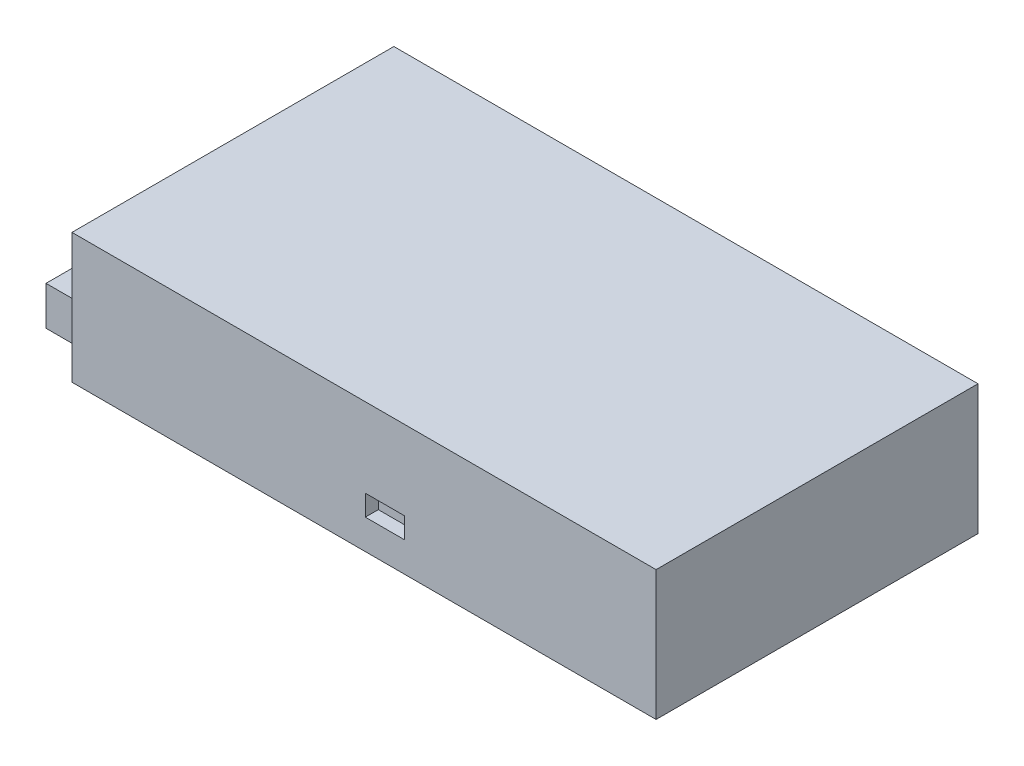
ISO-10303-21;
HEADER;
FILE_DESCRIPTION(('STEP AP214'),'2;1');
FILE_NAME('part.step','',(''),(''),'','','');
FILE_SCHEMA(('AUTOMOTIVE_DESIGN { 1 0 10303 214 1 1 1 1 }'));
ENDSEC;
DATA;
#1=APPLICATION_CONTEXT('core data for automotive mechanical design processes');
#2=APPLICATION_PROTOCOL_DEFINITION('international standard','automotive_design',2000,#1);
#3=PRODUCT_CONTEXT('',#1,'mechanical');
#4=PRODUCT('Part','Part','',(#3));
#5=PRODUCT_RELATED_PRODUCT_CATEGORY('part','',(#4));
#6=PRODUCT_DEFINITION_FORMATION('','',#4);
#7=PRODUCT_DEFINITION_CONTEXT('part definition',#1,'design');
#8=PRODUCT_DEFINITION('design','',#6,#7);
#9=PRODUCT_DEFINITION_SHAPE('','',#8);
#10=(LENGTH_UNIT() NAMED_UNIT(*) SI_UNIT(.MILLI.,.METRE.));
#11=(NAMED_UNIT(*) PLANE_ANGLE_UNIT() SI_UNIT($,.RADIAN.));
#12=(NAMED_UNIT(*) SI_UNIT($,.STERADIAN.) SOLID_ANGLE_UNIT());
#13=UNCERTAINTY_MEASURE_WITH_UNIT(LENGTH_MEASURE(1.E-05),#10,'distance_accuracy_value','');
#14=(GEOMETRIC_REPRESENTATION_CONTEXT(3) GLOBAL_UNCERTAINTY_ASSIGNED_CONTEXT((#13)) GLOBAL_UNIT_ASSIGNED_CONTEXT((#10,
#11,#12)) REPRESENTATION_CONTEXT('',''));
#15=CARTESIAN_POINT('',(0.,0.,0.));
#16=DIRECTION('',(0.,0.,1.));
#17=DIRECTION('',(1.,0.,0.));
#18=AXIS2_PLACEMENT_3D('',#15,#16,#17);
#19=CARTESIAN_POINT('',(-112.5,50.,-62.));
#20=DIRECTION('',(1.,0.,0.));
#21=DIRECTION('',(0.,0.,-1.));
#22=AXIS2_PLACEMENT_3D('',#19,#20,#21);
#23=PLANE('',#22);
#24=DIRECTION('',(0.,0.,1.));
#25=VECTOR('',#24,1.);
#26=CARTESIAN_POINT('',(-112.5,0.,-62.));
#27=LINE('',#26,#25);
#28=CARTESIAN_POINT('',(-112.5,0.,-62.));
#29=VERTEX_POINT('',#28);
#30=CARTESIAN_POINT('',(-112.5,0.,62.));
#31=VERTEX_POINT('',#30);
#32=EDGE_CURVE('E201',#29,#31,#27,.T.);
#33=ORIENTED_EDGE('',*,*,#32,.T.);
#34=DIRECTION('',(0.,-1.,0.));
#35=VECTOR('',#34,1.);
#36=CARTESIAN_POINT('',(-112.5,50.,62.));
#37=LINE('',#36,#35);
#38=CARTESIAN_POINT('',(-112.5,50.,62.));
#39=VERTEX_POINT('',#38);
#40=EDGE_CURVE('E11',#39,#31,#37,.T.);
#41=ORIENTED_EDGE('',*,*,#40,.F.);
#42=DIRECTION('',(0.,0.,1.));
#43=VECTOR('',#42,1.);
#44=CARTESIAN_POINT('',(-112.5,50.,-62.));
#45=LINE('',#44,#43);
#46=CARTESIAN_POINT('',(-112.5,50.,-62.));
#47=VERTEX_POINT('',#46);
#48=EDGE_CURVE('E204',#47,#39,#45,.T.);
#49=ORIENTED_EDGE('',*,*,#48,.F.);
#50=DIRECTION('',(0.,-1.,0.));
#51=VECTOR('',#50,1.);
#52=CARTESIAN_POINT('',(-112.5,50.,-62.));
#53=LINE('',#52,#51);
#54=EDGE_CURVE('E214',#47,#29,#53,.T.);
#55=ORIENTED_EDGE('',*,*,#54,.T.);
#56=EDGE_LOOP('',(#33,#41,#49,#55));
#57=FACE_BOUND('',#56,.T.);
#58=DIRECTION('',(0.,-1.,0.));
#59=VECTOR('',#58,1.);
#60=CARTESIAN_POINT('',(-112.5,25.,-47.));
#61=LINE('',#60,#59);
#62=CARTESIAN_POINT('',(-112.5,25.,-47.));
#63=VERTEX_POINT('',#62);
#64=CARTESIAN_POINT('',(-112.5,10.,-47.));
#65=VERTEX_POINT('',#64);
#66=EDGE_CURVE('E141',#63,#65,#61,.T.);
#67=ORIENTED_EDGE('',*,*,#66,.F.);
#68=DIRECTION('',(0.,0.,-1.));
#69=VECTOR('',#68,1.);
#70=CARTESIAN_POINT('',(-112.5,25.,-47.));
#71=LINE('',#70,#69);
#72=CARTESIAN_POINT('',(-112.5,25.,59.));
#73=VERTEX_POINT('',#72);
#74=EDGE_CURVE('E138',#73,#63,#71,.T.);
#75=ORIENTED_EDGE('',*,*,#74,.F.);
#76=DIRECTION('',(0.,1.,0.));
#77=VECTOR('',#76,1.);
#78=CARTESIAN_POINT('',(-112.5,25.,59.));
#79=LINE('',#78,#77);
#80=CARTESIAN_POINT('',(-112.5,10.,59.));
#81=VERTEX_POINT('',#80);
#82=EDGE_CURVE('E52',#81,#73,#79,.T.);
#83=ORIENTED_EDGE('',*,*,#82,.F.);
#84=DIRECTION('',(0.,0.,1.));
#85=VECTOR('',#84,1.);
#86=CARTESIAN_POINT('',(-112.5,10.,-47.));
#87=LINE('',#86,#85);
#88=EDGE_CURVE('E47',#65,#81,#87,.T.);
#89=ORIENTED_EDGE('',*,*,#88,.F.);
#90=EDGE_LOOP('',(#67,#75,#83,#89));
#91=FACE_BOUND('',#90,.T.);
#92=ADVANCED_FACE('F33',(#57,#91),#23,.F.);
#93=CARTESIAN_POINT('',(-112.5,50.,62.));
#94=DIRECTION('',(0.,0.,-1.));
#95=DIRECTION('',(-1.,0.,0.));
#96=AXIS2_PLACEMENT_3D('',#93,#94,#95);
#97=PLANE('',#96);
#98=DIRECTION('',(1.,0.,0.));
#99=VECTOR('',#98,1.);
#100=CARTESIAN_POINT('',(0.500000000000014,11.5,62.));
#101=LINE('',#100,#99);
#102=CARTESIAN_POINT('',(0.500000000000014,11.5,62.));
#103=VERTEX_POINT('',#102);
#104=CARTESIAN_POINT('',(15.5,11.5,62.));
#105=VERTEX_POINT('',#104);
#106=EDGE_CURVE('E144',#103,#105,#101,.T.);
#107=ORIENTED_EDGE('',*,*,#106,.F.);
#108=DIRECTION('',(0.,-1.,0.));
#109=VECTOR('',#108,1.);
#110=CARTESIAN_POINT('',(0.500000000000013,19.5,62.));
#111=LINE('',#110,#109);
#112=CARTESIAN_POINT('',(0.500000000000013,19.5,62.));
#113=VERTEX_POINT('',#112);
#114=EDGE_CURVE('E142',#113,#103,#111,.T.);
#115=ORIENTED_EDGE('',*,*,#114,.F.);
#116=DIRECTION('',(-1.,0.,0.));
#117=VECTOR('',#116,1.);
#118=CARTESIAN_POINT('',(0.500000000000013,19.5,62.));
#119=LINE('',#118,#117);
#120=CARTESIAN_POINT('',(15.5,19.5,62.));
#121=VERTEX_POINT('',#120);
#122=EDGE_CURVE('E154',#121,#113,#119,.T.);
#123=ORIENTED_EDGE('',*,*,#122,.F.);
#124=DIRECTION('',(0.,1.,0.));
#125=VECTOR('',#124,1.);
#126=CARTESIAN_POINT('',(15.5,19.5,62.));
#127=LINE('',#126,#125);
#128=EDGE_CURVE('E166',#105,#121,#127,.T.);
#129=ORIENTED_EDGE('',*,*,#128,.F.);
#130=EDGE_LOOP('',(#107,#115,#123,#129));
#131=FACE_BOUND('',#130,.T.);
#132=DIRECTION('',(1.,0.,0.));
#133=VECTOR('',#132,1.);
#134=CARTESIAN_POINT('',(-112.5,0.,62.));
#135=LINE('',#134,#133);
#136=CARTESIAN_POINT('',(112.5,0.,62.));
#137=VERTEX_POINT('',#136);
#138=EDGE_CURVE('E217',#31,#137,#135,.T.);
#139=ORIENTED_EDGE('',*,*,#138,.T.);
#140=DIRECTION('',(0.,-1.,0.));
#141=VECTOR('',#140,1.);
#142=CARTESIAN_POINT('',(112.5,50.,62.));
#143=LINE('',#142,#141);
#144=CARTESIAN_POINT('',(112.5,50.,62.));
#145=VERTEX_POINT('',#144);
#146=EDGE_CURVE('E40',#145,#137,#143,.T.);
#147=ORIENTED_EDGE('',*,*,#146,.F.);
#148=DIRECTION('',(1.,0.,0.));
#149=VECTOR('',#148,1.);
#150=CARTESIAN_POINT('',(-112.5,50.,62.));
#151=LINE('',#150,#149);
#152=EDGE_CURVE('E207',#39,#145,#151,.T.);
#153=ORIENTED_EDGE('',*,*,#152,.F.);
#154=ORIENTED_EDGE('',*,*,#40,.T.);
#155=EDGE_LOOP('',(#139,#147,#153,#154));
#156=FACE_BOUND('',#155,.T.);
#157=ADVANCED_FACE('F247',(#131,#156),#97,.F.);
#158=CARTESIAN_POINT('',(112.5,50.,-62.));
#159=DIRECTION('',(-1.,0.,0.));
#160=DIRECTION('',(0.,0.,1.));
#161=AXIS2_PLACEMENT_3D('',#158,#159,#160);
#162=PLANE('',#161);
#163=DIRECTION('',(0.,0.,-1.));
#164=VECTOR('',#163,1.);
#165=CARTESIAN_POINT('',(112.5,0.,-62.));
#166=LINE('',#165,#164);
#167=CARTESIAN_POINT('',(112.5,0.,-62.));
#168=VERTEX_POINT('',#167);
#169=EDGE_CURVE('E219',#137,#168,#166,.T.);
#170=ORIENTED_EDGE('',*,*,#169,.T.);
#171=DIRECTION('',(0.,-1.,0.));
#172=VECTOR('',#171,1.);
#173=CARTESIAN_POINT('',(112.5,50.,-62.));
#174=LINE('',#173,#172);
#175=CARTESIAN_POINT('',(112.5,50.,-62.));
#176=VERTEX_POINT('',#175);
#177=EDGE_CURVE('E224',#176,#168,#174,.T.);
#178=ORIENTED_EDGE('',*,*,#177,.F.);
#179=DIRECTION('',(0.,0.,-1.));
#180=VECTOR('',#179,1.);
#181=CARTESIAN_POINT('',(112.5,50.,-62.));
#182=LINE('',#181,#180);
#183=EDGE_CURVE('E210',#145,#176,#182,.T.);
#184=ORIENTED_EDGE('',*,*,#183,.F.);
#185=ORIENTED_EDGE('',*,*,#146,.T.);
#186=EDGE_LOOP('',(#170,#178,#184,#185));
#187=FACE_BOUND('',#186,.T.);
#188=ADVANCED_FACE('F231',(#187),#162,.F.);
#189=CARTESIAN_POINT('',(-112.5,50.,-62.));
#190=DIRECTION('',(0.,0.,1.));
#191=DIRECTION('',(1.,0.,0.));
#192=AXIS2_PLACEMENT_3D('',#189,#190,#191);
#193=PLANE('',#192);
#194=DIRECTION('',(-1.,0.,0.));
#195=VECTOR('',#194,1.);
#196=CARTESIAN_POINT('',(-112.5,0.,-62.));
#197=LINE('',#196,#195);
#198=EDGE_CURVE('E208',#168,#29,#197,.T.);
#199=ORIENTED_EDGE('',*,*,#198,.T.);
#200=ORIENTED_EDGE('',*,*,#54,.F.);
#201=DIRECTION('',(-1.,0.,0.));
#202=VECTOR('',#201,1.);
#203=CARTESIAN_POINT('',(-112.5,50.,-62.));
#204=LINE('',#203,#202);
#205=EDGE_CURVE('E212',#176,#47,#204,.T.);
#206=ORIENTED_EDGE('',*,*,#205,.F.);
#207=ORIENTED_EDGE('',*,*,#177,.T.);
#208=EDGE_LOOP('',(#199,#200,#206,#207));
#209=FACE_BOUND('',#208,.T.);
#210=ADVANCED_FACE('F240',(#209),#193,.F.);
#211=CARTESIAN_POINT('',(-112.5,50.,62.));
#212=DIRECTION('',(0.,1.,0.));
#213=DIRECTION('',(0.,0.,1.));
#214=AXIS2_PLACEMENT_3D('',#211,#212,#213);
#215=PLANE('',#214);
#216=ORIENTED_EDGE('',*,*,#48,.T.);
#217=ORIENTED_EDGE('',*,*,#152,.T.);
#218=ORIENTED_EDGE('',*,*,#183,.T.);
#219=ORIENTED_EDGE('',*,*,#205,.T.);
#220=EDGE_LOOP('',(#216,#217,#218,#219));
#221=FACE_BOUND('',#220,.T.);
#222=ADVANCED_FACE('F246',(#221),#215,.T.);
#223=CARTESIAN_POINT('',(-112.5,0.,62.));
#224=DIRECTION('',(0.,1.,0.));
#225=DIRECTION('',(0.,0.,1.));
#226=AXIS2_PLACEMENT_3D('',#223,#224,#225);
#227=PLANE('',#226);
#228=CARTESIAN_POINT('',(70.9999999999999,0.,24.5));
#229=DIRECTION('',(0.,-1.,0.));
#230=DIRECTION('',(0.,0.,-1.));
#231=AXIS2_PLACEMENT_3D('',#228,#229,#230);
#232=CIRCLE('',#231,2.);
#233=CARTESIAN_POINT('',(70.9999999999999,0.,22.5));
#234=VERTEX_POINT('',#233);
#235=EDGE_CURVE('E173',#234,#234,#232,.T.);
#236=ORIENTED_EDGE('',*,*,#235,.F.);
#237=EDGE_LOOP('',(#236));
#238=FACE_BOUND('',#237,.T.);
#239=CARTESIAN_POINT('',(70.9999999999999,0.,-25.5));
#240=DIRECTION('',(0.,-1.,0.));
#241=DIRECTION('',(0.,0.,-1.));
#242=AXIS2_PLACEMENT_3D('',#239,#240,#241);
#243=CIRCLE('',#242,2.);
#244=CARTESIAN_POINT('',(70.9999999999999,0.,-27.5));
#245=VERTEX_POINT('',#244);
#246=EDGE_CURVE('E183',#245,#245,#243,.T.);
#247=ORIENTED_EDGE('',*,*,#246,.F.);
#248=EDGE_LOOP('',(#247));
#249=FACE_BOUND('',#248,.T.);
#250=CARTESIAN_POINT('',(-79.0000000000001,0.,24.5));
#251=DIRECTION('',(0.,-1.,0.));
#252=DIRECTION('',(0.,0.,-1.));
#253=AXIS2_PLACEMENT_3D('',#250,#251,#252);
#254=CIRCLE('',#253,2.);
#255=CARTESIAN_POINT('',(-79.0000000000001,0.,22.5));
#256=VERTEX_POINT('',#255);
#257=EDGE_CURVE('E189',#256,#256,#254,.T.);
#258=ORIENTED_EDGE('',*,*,#257,.F.);
#259=EDGE_LOOP('',(#258));
#260=FACE_BOUND('',#259,.T.);
#261=CARTESIAN_POINT('',(-79.0000000000001,0.,-25.5));
#262=DIRECTION('',(0.,-1.,0.));
#263=DIRECTION('',(0.,0.,-1.));
#264=AXIS2_PLACEMENT_3D('',#261,#262,#263);
#265=CIRCLE('',#264,2.);
#266=CARTESIAN_POINT('',(-79.0000000000001,0.,-27.5));
#267=VERTEX_POINT('',#266);
#268=EDGE_CURVE('E195',#267,#267,#265,.T.);
#269=ORIENTED_EDGE('',*,*,#268,.F.);
#270=EDGE_LOOP('',(#269));
#271=FACE_BOUND('',#270,.T.);
#272=ORIENTED_EDGE('',*,*,#32,.F.);
#273=ORIENTED_EDGE('',*,*,#198,.F.);
#274=ORIENTED_EDGE('',*,*,#169,.F.);
#275=ORIENTED_EDGE('',*,*,#138,.F.);
#276=EDGE_LOOP('',(#272,#273,#274,#275));
#277=FACE_BOUND('',#276,.T.);
#278=ADVANCED_FACE('F237',(#238,#249,#260,#271,#277),#227,.F.);
#279=CARTESIAN_POINT('',(-79.0000000000001,5.,-25.5));
#280=DIRECTION('',(0.,-1.,0.));
#281=DIRECTION('',(0.,0.,-1.));
#282=AXIS2_PLACEMENT_3D('',#279,#280,#281);
#283=CYLINDRICAL_SURFACE('',#282,2.);
#284=CARTESIAN_POINT('',(-79.0000000000001,5.,-25.5));
#285=DIRECTION('',(0.,-1.,0.));
#286=DIRECTION('',(0.,0.,-1.));
#287=AXIS2_PLACEMENT_3D('',#284,#285,#286);
#288=CIRCLE('',#287,2.);
#289=CARTESIAN_POINT('',(-79.0000000000001,5.,-27.5));
#290=VERTEX_POINT('',#289);
#291=EDGE_CURVE('E198',#290,#290,#288,.T.);
#292=ORIENTED_EDGE('',*,*,#291,.F.);
#293=EDGE_LOOP('',(#292));
#294=FACE_BOUND('',#293,.T.);
#295=ORIENTED_EDGE('',*,*,#268,.T.);
#296=EDGE_LOOP('',(#295));
#297=FACE_BOUND('',#296,.T.);
#298=ADVANCED_FACE('F261',(#294,#297),#283,.F.);
#299=CARTESIAN_POINT('',(-79.0000000000001,5.,-25.5));
#300=DIRECTION('',(0.,-1.,0.));
#301=DIRECTION('',(0.,0.,-1.));
#302=AXIS2_PLACEMENT_3D('',#299,#300,#301);
#303=PLANE('',#302);
#304=ORIENTED_EDGE('',*,*,#291,.T.);
#305=EDGE_LOOP('',(#304));
#306=FACE_BOUND('',#305,.T.);
#307=ADVANCED_FACE('F267',(#306),#303,.T.);
#308=CARTESIAN_POINT('',(-79.0000000000001,5.,24.5));
#309=DIRECTION('',(0.,-1.,0.));
#310=DIRECTION('',(0.,0.,-1.));
#311=AXIS2_PLACEMENT_3D('',#308,#309,#310);
#312=CYLINDRICAL_SURFACE('',#311,2.);
#313=CARTESIAN_POINT('',(-79.0000000000001,5.,24.5));
#314=DIRECTION('',(0.,-1.,0.));
#315=DIRECTION('',(0.,0.,-1.));
#316=AXIS2_PLACEMENT_3D('',#313,#314,#315);
#317=CIRCLE('',#316,2.);
#318=CARTESIAN_POINT('',(-79.0000000000001,5.,22.5));
#319=VERTEX_POINT('',#318);
#320=EDGE_CURVE('E192',#319,#319,#317,.T.);
#321=ORIENTED_EDGE('',*,*,#320,.F.);
#322=EDGE_LOOP('',(#321));
#323=FACE_BOUND('',#322,.T.);
#324=ORIENTED_EDGE('',*,*,#257,.T.);
#325=EDGE_LOOP('',(#324));
#326=FACE_BOUND('',#325,.T.);
#327=ADVANCED_FACE('F271',(#323,#326),#312,.F.);
#328=CARTESIAN_POINT('',(-79.0000000000001,5.,24.5));
#329=DIRECTION('',(0.,-1.,0.));
#330=DIRECTION('',(0.,0.,-1.));
#331=AXIS2_PLACEMENT_3D('',#328,#329,#330);
#332=PLANE('',#331);
#333=ORIENTED_EDGE('',*,*,#320,.T.);
#334=EDGE_LOOP('',(#333));
#335=FACE_BOUND('',#334,.T.);
#336=ADVANCED_FACE('F275',(#335),#332,.T.);
#337=CARTESIAN_POINT('',(70.9999999999999,5.,-25.5));
#338=DIRECTION('',(0.,-1.,0.));
#339=DIRECTION('',(0.,0.,-1.));
#340=AXIS2_PLACEMENT_3D('',#337,#338,#339);
#341=CYLINDRICAL_SURFACE('',#340,2.);
#342=CARTESIAN_POINT('',(70.9999999999999,5.,-25.5));
#343=DIRECTION('',(0.,-1.,0.));
#344=DIRECTION('',(0.,0.,-1.));
#345=AXIS2_PLACEMENT_3D('',#342,#343,#344);
#346=CIRCLE('',#345,2.);
#347=CARTESIAN_POINT('',(70.9999999999999,5.,-27.5));
#348=VERTEX_POINT('',#347);
#349=EDGE_CURVE('E186',#348,#348,#346,.T.);
#350=ORIENTED_EDGE('',*,*,#349,.F.);
#351=EDGE_LOOP('',(#350));
#352=FACE_BOUND('',#351,.T.);
#353=ORIENTED_EDGE('',*,*,#246,.T.);
#354=EDGE_LOOP('',(#353));
#355=FACE_BOUND('',#354,.T.);
#356=ADVANCED_FACE('F279',(#352,#355),#341,.F.);
#357=CARTESIAN_POINT('',(70.9999999999999,5.,-25.5));
#358=DIRECTION('',(0.,-1.,0.));
#359=DIRECTION('',(0.,0.,-1.));
#360=AXIS2_PLACEMENT_3D('',#357,#358,#359);
#361=PLANE('',#360);
#362=ORIENTED_EDGE('',*,*,#349,.T.);
#363=EDGE_LOOP('',(#362));
#364=FACE_BOUND('',#363,.T.);
#365=ADVANCED_FACE('F283',(#364),#361,.T.);
#366=CARTESIAN_POINT('',(70.9999999999999,5.,24.5));
#367=DIRECTION('',(0.,-1.,0.));
#368=DIRECTION('',(0.,0.,-1.));
#369=AXIS2_PLACEMENT_3D('',#366,#367,#368);
#370=CYLINDRICAL_SURFACE('',#369,2.);
#371=CARTESIAN_POINT('',(70.9999999999999,5.,24.5));
#372=DIRECTION('',(0.,-1.,0.));
#373=DIRECTION('',(0.,0.,-1.));
#374=AXIS2_PLACEMENT_3D('',#371,#372,#373);
#375=CIRCLE('',#374,2.);
#376=CARTESIAN_POINT('',(70.9999999999999,5.,22.5));
#377=VERTEX_POINT('',#376);
#378=EDGE_CURVE('E180',#377,#377,#375,.T.);
#379=ORIENTED_EDGE('',*,*,#378,.F.);
#380=EDGE_LOOP('',(#379));
#381=FACE_BOUND('',#380,.T.);
#382=ORIENTED_EDGE('',*,*,#235,.T.);
#383=EDGE_LOOP('',(#382));
#384=FACE_BOUND('',#383,.T.);
#385=ADVANCED_FACE('F287',(#381,#384),#370,.F.);
#386=CARTESIAN_POINT('',(70.9999999999999,5.,24.5));
#387=DIRECTION('',(0.,-1.,0.));
#388=DIRECTION('',(0.,0.,-1.));
#389=AXIS2_PLACEMENT_3D('',#386,#387,#388);
#390=PLANE('',#389);
#391=ORIENTED_EDGE('',*,*,#378,.T.);
#392=EDGE_LOOP('',(#391));
#393=FACE_BOUND('',#392,.T.);
#394=ADVANCED_FACE('F291',(#393),#390,.T.);
#395=CARTESIAN_POINT('',(0.500000000000013,19.5,57.));
#396=DIRECTION('',(-1.,0.,0.));
#397=DIRECTION('',(0.,-1.,0.));
#398=AXIS2_PLACEMENT_3D('',#395,#396,#397);
#399=PLANE('',#398);
#400=ORIENTED_EDGE('',*,*,#114,.T.);
#401=DIRECTION('',(0.,0.,1.));
#402=VECTOR('',#401,1.);
#403=CARTESIAN_POINT('',(0.500000000000014,11.5,57.));
#404=LINE('',#403,#402);
#405=CARTESIAN_POINT('',(0.500000000000014,11.5,57.));
#406=VERTEX_POINT('',#405);
#407=EDGE_CURVE('E162',#406,#103,#404,.T.);
#408=ORIENTED_EDGE('',*,*,#407,.F.);
#409=DIRECTION('',(0.,-1.,0.));
#410=VECTOR('',#409,1.);
#411=CARTESIAN_POINT('',(0.500000000000013,19.5,57.));
#412=LINE('',#411,#410);
#413=CARTESIAN_POINT('',(0.500000000000013,19.5,57.));
#414=VERTEX_POINT('',#413);
#415=EDGE_CURVE('E150',#414,#406,#412,.T.);
#416=ORIENTED_EDGE('',*,*,#415,.F.);
#417=DIRECTION('',(0.,0.,1.));
#418=VECTOR('',#417,1.);
#419=CARTESIAN_POINT('',(0.500000000000013,19.5,57.));
#420=LINE('',#419,#418);
#421=EDGE_CURVE('E171',#414,#113,#420,.T.);
#422=ORIENTED_EDGE('',*,*,#421,.T.);
#423=EDGE_LOOP('',(#400,#408,#416,#422));
#424=FACE_BOUND('',#423,.T.);
#425=ADVANCED_FACE('F295',(#424),#399,.F.);
#426=CARTESIAN_POINT('',(0.500000000000013,19.5,57.));
#427=DIRECTION('',(0.,1.,0.));
#428=DIRECTION('',(0.,0.,1.));
#429=AXIS2_PLACEMENT_3D('',#426,#427,#428);
#430=PLANE('',#429);
#431=ORIENTED_EDGE('',*,*,#122,.T.);
#432=ORIENTED_EDGE('',*,*,#421,.F.);
#433=DIRECTION('',(-1.,0.,0.));
#434=VECTOR('',#433,1.);
#435=CARTESIAN_POINT('',(0.500000000000013,19.5,57.));
#436=LINE('',#435,#434);
#437=CARTESIAN_POINT('',(15.5,19.5,57.));
#438=VERTEX_POINT('',#437);
#439=EDGE_CURVE('E160',#438,#414,#436,.T.);
#440=ORIENTED_EDGE('',*,*,#439,.F.);
#441=DIRECTION('',(0.,0.,1.));
#442=VECTOR('',#441,1.);
#443=CARTESIAN_POINT('',(15.5,19.5,57.));
#444=LINE('',#443,#442);
#445=EDGE_CURVE('E174',#438,#121,#444,.T.);
#446=ORIENTED_EDGE('',*,*,#445,.T.);
#447=EDGE_LOOP('',(#431,#432,#440,#446));
#448=FACE_BOUND('',#447,.T.);
#449=ADVANCED_FACE('F299',(#448),#430,.F.);
#450=CARTESIAN_POINT('',(15.5,19.5,57.));
#451=DIRECTION('',(1.,0.,0.));
#452=DIRECTION('',(0.,1.,0.));
#453=AXIS2_PLACEMENT_3D('',#450,#451,#452);
#454=PLANE('',#453);
#455=ORIENTED_EDGE('',*,*,#128,.T.);
#456=ORIENTED_EDGE('',*,*,#445,.F.);
#457=DIRECTION('',(0.,1.,0.));
#458=VECTOR('',#457,1.);
#459=CARTESIAN_POINT('',(15.5,19.5,57.));
#460=LINE('',#459,#458);
#461=CARTESIAN_POINT('',(15.5,11.5,57.));
#462=VERTEX_POINT('',#461);
#463=EDGE_CURVE('E157',#462,#438,#460,.T.);
#464=ORIENTED_EDGE('',*,*,#463,.F.);
#465=DIRECTION('',(0.,0.,1.));
#466=VECTOR('',#465,1.);
#467=CARTESIAN_POINT('',(15.5,11.5,57.));
#468=LINE('',#467,#466);
#469=EDGE_CURVE('E176',#462,#105,#468,.T.);
#470=ORIENTED_EDGE('',*,*,#469,.T.);
#471=EDGE_LOOP('',(#455,#456,#464,#470));
#472=FACE_BOUND('',#471,.T.);
#473=ADVANCED_FACE('F305',(#472),#454,.F.);
#474=CARTESIAN_POINT('',(0.500000000000014,11.5,57.));
#475=DIRECTION('',(0.,-1.,0.));
#476=DIRECTION('',(0.,0.,-1.));
#477=AXIS2_PLACEMENT_3D('',#474,#475,#476);
#478=PLANE('',#477);
#479=ORIENTED_EDGE('',*,*,#106,.T.);
#480=ORIENTED_EDGE('',*,*,#469,.F.);
#481=DIRECTION('',(1.,0.,0.));
#482=VECTOR('',#481,1.);
#483=CARTESIAN_POINT('',(0.500000000000014,11.5,57.));
#484=LINE('',#483,#482);
#485=EDGE_CURVE('E153',#406,#462,#484,.T.);
#486=ORIENTED_EDGE('',*,*,#485,.F.);
#487=ORIENTED_EDGE('',*,*,#407,.T.);
#488=EDGE_LOOP('',(#479,#480,#486,#487));
#489=FACE_BOUND('',#488,.T.);
#490=ADVANCED_FACE('F301',(#489),#478,.F.);
#491=CARTESIAN_POINT('',(0.500000000000014,11.5,57.));
#492=DIRECTION('',(0.,0.,1.));
#493=DIRECTION('',(1.,0.,0.));
#494=AXIS2_PLACEMENT_3D('',#491,#492,#493);
#495=PLANE('',#494);
#496=ORIENTED_EDGE('',*,*,#415,.T.);
#497=ORIENTED_EDGE('',*,*,#485,.T.);
#498=ORIENTED_EDGE('',*,*,#463,.T.);
#499=ORIENTED_EDGE('',*,*,#439,.T.);
#500=EDGE_LOOP('',(#496,#497,#498,#499));
#501=FACE_BOUND('',#500,.T.);
#502=ADVANCED_FACE('F304',(#501),#495,.T.);
#503=CARTESIAN_POINT('',(-125.5,25.,-47.));
#504=DIRECTION('',(0.,0.,1.));
#505=DIRECTION('',(1.,0.,0.));
#506=AXIS2_PLACEMENT_3D('',#503,#504,#505);
#507=PLANE('',#506);
#508=ORIENTED_EDGE('',*,*,#66,.T.);
#509=DIRECTION('',(1.,0.,0.));
#510=VECTOR('',#509,1.);
#511=CARTESIAN_POINT('',(-125.5,10.,-47.));
#512=LINE('',#511,#510);
#513=CARTESIAN_POINT('',(-125.5,10.,-47.));
#514=VERTEX_POINT('',#513);
#515=EDGE_CURVE('E122',#514,#65,#512,.T.);
#516=ORIENTED_EDGE('',*,*,#515,.F.);
#517=DIRECTION('',(0.,-1.,0.));
#518=VECTOR('',#517,1.);
#519=CARTESIAN_POINT('',(-125.5,25.,-47.));
#520=LINE('',#519,#518);
#521=CARTESIAN_POINT('',(-125.5,25.,-47.));
#522=VERTEX_POINT('',#521);
#523=EDGE_CURVE('E129',#522,#514,#520,.T.);
#524=ORIENTED_EDGE('',*,*,#523,.F.);
#525=DIRECTION('',(1.,0.,0.));
#526=VECTOR('',#525,1.);
#527=CARTESIAN_POINT('',(-125.5,25.,-47.));
#528=LINE('',#527,#526);
#529=EDGE_CURVE('E473',#522,#63,#528,.T.);
#530=ORIENTED_EDGE('',*,*,#529,.T.);
#531=EDGE_LOOP('',(#508,#516,#524,#530));
#532=FACE_BOUND('',#531,.T.);
#533=ADVANCED_FACE('F140',(#532),#507,.F.);
#534=CARTESIAN_POINT('',(-125.5,10.,-47.));
#535=DIRECTION('',(0.,1.,0.));
#536=DIRECTION('',(0.,0.,1.));
#537=AXIS2_PLACEMENT_3D('',#534,#535,#536);
#538=PLANE('',#537);
#539=ORIENTED_EDGE('',*,*,#88,.T.);
#540=DIRECTION('',(1.,0.,0.));
#541=VECTOR('',#540,1.);
#542=CARTESIAN_POINT('',(-125.5,10.,59.));
#543=LINE('',#542,#541);
#544=CARTESIAN_POINT('',(-125.5,10.,59.));
#545=VERTEX_POINT('',#544);
#546=EDGE_CURVE('E125',#545,#81,#543,.T.);
#547=ORIENTED_EDGE('',*,*,#546,.F.);
#548=DIRECTION('',(0.,0.,1.));
#549=VECTOR('',#548,1.);
#550=CARTESIAN_POINT('',(-125.5,10.,-47.));
#551=LINE('',#550,#549);
#552=EDGE_CURVE('E118',#514,#545,#551,.T.);
#553=ORIENTED_EDGE('',*,*,#552,.F.);
#554=ORIENTED_EDGE('',*,*,#515,.T.);
#555=EDGE_LOOP('',(#539,#547,#553,#554));
#556=FACE_BOUND('',#555,.T.);
#557=ADVANCED_FACE('F120',(#556),#538,.F.);
#558=CARTESIAN_POINT('',(-125.5,25.,59.));
#559=DIRECTION('',(0.,0.,-1.));
#560=DIRECTION('',(-1.,0.,0.));
#561=AXIS2_PLACEMENT_3D('',#558,#559,#560);
#562=PLANE('',#561);
#563=ORIENTED_EDGE('',*,*,#82,.T.);
#564=DIRECTION('',(1.,0.,0.));
#565=VECTOR('',#564,1.);
#566=CARTESIAN_POINT('',(-125.5,25.,59.));
#567=LINE('',#566,#565);
#568=CARTESIAN_POINT('',(-125.5,25.,59.));
#569=VERTEX_POINT('',#568);
#570=EDGE_CURVE('E146',#569,#73,#567,.T.);
#571=ORIENTED_EDGE('',*,*,#570,.F.);
#572=DIRECTION('',(0.,1.,0.));
#573=VECTOR('',#572,1.);
#574=CARTESIAN_POINT('',(-125.5,25.,59.));
#575=LINE('',#574,#573);
#576=EDGE_CURVE('E128',#545,#569,#575,.T.);
#577=ORIENTED_EDGE('',*,*,#576,.F.);
#578=ORIENTED_EDGE('',*,*,#546,.T.);
#579=EDGE_LOOP('',(#563,#571,#577,#578));
#580=FACE_BOUND('',#579,.T.);
#581=ADVANCED_FACE('F320',(#580),#562,.F.);
#582=CARTESIAN_POINT('',(-125.5,25.,-47.));
#583=DIRECTION('',(0.,-1.,0.));
#584=DIRECTION('',(0.,0.,-1.));
#585=AXIS2_PLACEMENT_3D('',#582,#583,#584);
#586=PLANE('',#585);
#587=ORIENTED_EDGE('',*,*,#74,.T.);
#588=ORIENTED_EDGE('',*,*,#529,.F.);
#589=DIRECTION('',(0.,0.,-1.));
#590=VECTOR('',#589,1.);
#591=CARTESIAN_POINT('',(-125.5,25.,-47.));
#592=LINE('',#591,#590);
#593=EDGE_CURVE('E134',#569,#522,#592,.T.);
#594=ORIENTED_EDGE('',*,*,#593,.F.);
#595=ORIENTED_EDGE('',*,*,#570,.T.);
#596=EDGE_LOOP('',(#587,#588,#594,#595));
#597=FACE_BOUND('',#596,.T.);
#598=ADVANCED_FACE('F323',(#597),#586,.F.);
#599=CARTESIAN_POINT('',(-125.5,10.,-47.));
#600=DIRECTION('',(-1.,0.,0.));
#601=DIRECTION('',(0.,0.,1.));
#602=AXIS2_PLACEMENT_3D('',#599,#600,#601);
#603=PLANE('',#602);
#604=ORIENTED_EDGE('',*,*,#523,.T.);
#605=ORIENTED_EDGE('',*,*,#552,.T.);
#606=ORIENTED_EDGE('',*,*,#576,.T.);
#607=ORIENTED_EDGE('',*,*,#593,.T.);
#608=EDGE_LOOP('',(#604,#605,#606,#607));
#609=FACE_BOUND('',#608,.T.);
#610=ADVANCED_FACE('F132',(#609),#603,.T.);
#611=CLOSED_SHELL('',(#92,#157,#188,#210,#222,#278,#298,#307,#327,#336,#356,#365,#385,#394,#425,
#449,#473,#490,#502,#533,#557,#581,#598,#610));
#612=MANIFOLD_SOLID_BREP('B2',#611);
#613=ADVANCED_BREP_SHAPE_REPRESENTATION('',(#18,#612),#14);
#614=SHAPE_DEFINITION_REPRESENTATION(#9,#613);
ENDSEC;
END-ISO-10303-21;
